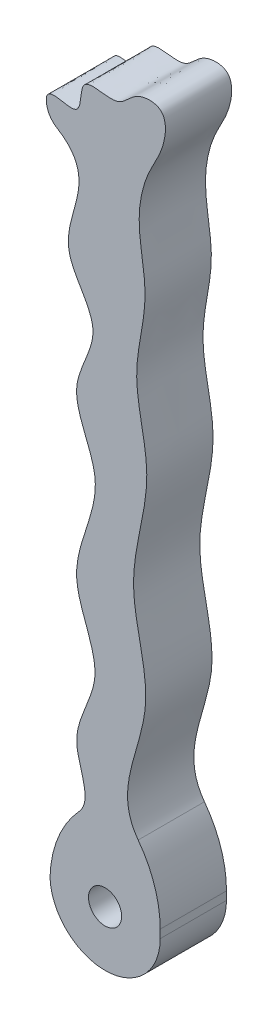
ISO-10303-21;
HEADER;
FILE_DESCRIPTION(('STEP AP214'),'2;1');
FILE_NAME('part.step','',(''),(''),'','','');
FILE_SCHEMA(('AUTOMOTIVE_DESIGN { 1 0 10303 214 1 1 1 1 }'));
ENDSEC;
DATA;
#1=APPLICATION_CONTEXT('core data for automotive mechanical design processes');
#2=APPLICATION_PROTOCOL_DEFINITION('international standard','automotive_design',2000,#1);
#3=PRODUCT_CONTEXT('',#1,'mechanical');
#4=PRODUCT('Part','Part','',(#3));
#5=PRODUCT_RELATED_PRODUCT_CATEGORY('part','',(#4));
#6=PRODUCT_DEFINITION_FORMATION('','',#4);
#7=PRODUCT_DEFINITION_CONTEXT('part definition',#1,'design');
#8=PRODUCT_DEFINITION('design','',#6,#7);
#9=PRODUCT_DEFINITION_SHAPE('','',#8);
#10=(LENGTH_UNIT() NAMED_UNIT(*) SI_UNIT(.MILLI.,.METRE.));
#11=(NAMED_UNIT(*) PLANE_ANGLE_UNIT() SI_UNIT($,.RADIAN.));
#12=(NAMED_UNIT(*) SI_UNIT($,.STERADIAN.) SOLID_ANGLE_UNIT());
#13=UNCERTAINTY_MEASURE_WITH_UNIT(LENGTH_MEASURE(1.E-05),#10,'distance_accuracy_value','');
#14=(GEOMETRIC_REPRESENTATION_CONTEXT(3) GLOBAL_UNCERTAINTY_ASSIGNED_CONTEXT((#13)) GLOBAL_UNIT_ASSIGNED_CONTEXT((#10,
#11,#12)) REPRESENTATION_CONTEXT('',''));
#15=CARTESIAN_POINT('',(0.,0.,0.));
#16=DIRECTION('',(0.,0.,1.));
#17=DIRECTION('',(1.,0.,0.));
#18=AXIS2_PLACEMENT_3D('',#15,#16,#17);
#19=CARTESIAN_POINT('',(4.07432307287909,27.0040889400727,6.));
#20=DIRECTION('',(0.,0.,1.));
#21=DIRECTION('',(1.,0.,0.));
#22=AXIS2_PLACEMENT_3D('',#19,#20,#21);
#23=PLANE('',#22);
#24=CARTESIAN_POINT('',(4.99,-4.99,6.));
#25=DIRECTION('',(0.,0.,1.));
#26=DIRECTION('',(1.,0.,0.));
#27=AXIS2_PLACEMENT_3D('',#24,#25,#26);
#28=CIRCLE('',#27,1.5);
#29=CARTESIAN_POINT('',(6.49,-4.99,6.));
#30=VERTEX_POINT('',#29);
#31=EDGE_CURVE('E137',#30,#30,#28,.T.);
#32=ORIENTED_EDGE('',*,*,#31,.F.);
#33=EDGE_LOOP('',(#32));
#34=FACE_BOUND('',#33,.T.);
#35=CARTESIAN_POINT('',(4.99,-4.99,6.));
#36=DIRECTION('',(0.,0.,1.));
#37=DIRECTION('',(1.,0.,0.));
#38=AXIS2_PLACEMENT_3D('',#35,#36,#37);
#39=CIRCLE('',#38,4.99);
#40=CARTESIAN_POINT('',(0.0036431932544205,-5.18064573381548,6.));
#41=VERTEX_POINT('',#40);
#42=CARTESIAN_POINT('',(9.98,-4.99,6.));
#43=VERTEX_POINT('',#42);
#44=EDGE_CURVE('E68',#41,#43,#39,.T.);
#45=ORIENTED_EDGE('',*,*,#44,.T.);
#46=DIRECTION('',(0.,1.,0.));
#47=VECTOR('',#46,1.);
#48=CARTESIAN_POINT('',(9.98,0.,6.));
#49=LINE('',#48,#47);
#50=CARTESIAN_POINT('',(9.98,-4.24386459225263,6.));
#51=VERTEX_POINT('',#50);
#52=EDGE_CURVE('E125',#43,#51,#49,.T.);
#53=ORIENTED_EDGE('',*,*,#52,.T.);
#54=CARTESIAN_POINT('',(-0.019999999999994,-4.24386459225263,6.));
#55=DIRECTION('',(0.,0.,1.));
#56=DIRECTION('',(1.,0.,0.));
#57=AXIS2_PLACEMENT_3D('',#54,#55,#56);
#58=CIRCLE('',#57,10.);
#59=CARTESIAN_POINT('',(7.98667396026505,1.74722646814812,6.));
#60=VERTEX_POINT('',#59);
#61=EDGE_CURVE('E160',#51,#60,#58,.T.);
#62=ORIENTED_EDGE('',*,*,#61,.T.);
#63=CARTESIAN_POINT('',(9.98,0.,6.));
#64=CARTESIAN_POINT('',(4.47490342142003,3.41650030145823,6.));
#65=CARTESIAN_POINT('',(10.7936674391867,11.1068859543439,6.));
#66=CARTESIAN_POINT('',(6.27028507343575,21.6732779777969,6.));
#67=CARTESIAN_POINT('',(9.84685355959956,30.2170188192904,6.));
#68=CARTESIAN_POINT('',(7.04609088717876,37.9736386752195,6.));
#69=CARTESIAN_POINT('',(9.26798486640884,44.5548895483187,6.));
#70=CARTESIAN_POINT('',(7.62484325053739,50.0403947930808,6.));
#71=CARTESIAN_POINT('',(8.66789346375684,54.3949271019187,6.));
#72=CARTESIAN_POINT('',(10.3371393951587,56.9019071742576,6.));
#73=CARTESIAN_POINT('',(10.8089638488774,60.4276984708432,6.));
#74=CARTESIAN_POINT('',(7.55999927260026,60.3083173980665,6.));
#75=CARTESIAN_POINT('',(6.24965715028379,57.9313320963328,6.));
#76=CARTESIAN_POINT('',(2.42632039661146,59.6713179523339,6.));
#77=CARTESIAN_POINT('',(3.2646972893959,54.364229545974,6.));
#78=CARTESIAN_POINT('',(-1.30019080009667,57.7321860270189,6.));
#79=CARTESIAN_POINT('',(0.,54.250736403552,6.));
#80=B_SPLINE_CURVE_WITH_KNOTS('',3,(#63,#64,#65,#66,#67,#68,#69,#70,#71,#72,#73,#74,#75,#76,#77,
#78,#79),.UNSPECIFIED.,.F.,.F.,(4,1,1,1,1,1,1,1,1,1,1,1,1,1,4),(0.,0.180812650342829,
0.29970693583266,0.426660188475201,0.523332248705061,0.611743870396005,0.68980196449708,
0.745444426402453,0.779487000439942,0.81881785744757,0.846512416164004,0.876173707632325,
0.915946811986844,0.946577953377389,1.),.UNSPECIFIED.);
#81=CARTESIAN_POINT('',(-0.295395150182294,55.2640439851758,6.));
#82=VERTEX_POINT('',#81);
#83=EDGE_CURVE('E152',#60,#82,#80,.T.);
#84=ORIENTED_EDGE('',*,*,#83,.T.);
#85=CARTESIAN_POINT('',(1.67511452998441,55.6062304845724,6.));
#86=DIRECTION('',(0.,0.,1.));
#87=DIRECTION('',(1.,0.,0.));
#88=AXIS2_PLACEMENT_3D('',#85,#86,#87);
#89=CIRCLE('',#88,2.);
#90=CARTESIAN_POINT('',(0.626417711124496,53.9032228562533,6.));
#91=VERTEX_POINT('',#90);
#92=EDGE_CURVE('E12',#82,#91,#89,.T.);
#93=ORIENTED_EDGE('',*,*,#92,.T.);
#94=CARTESIAN_POINT('',(0.,54.250736403552,6.));
#95=CARTESIAN_POINT('',(5.08439592728796,51.6989193078807,6.));
#96=CARTESIAN_POINT('',(-1.04048183505963,45.9919036493983,6.));
#97=CARTESIAN_POINT('',(5.44732212434061,39.8872478034224,6.));
#98=CARTESIAN_POINT('',(0.909066537170768,34.1690364818433,6.));
#99=CARTESIAN_POINT('',(6.00541926463897,27.5033546621597,6.));
#100=CARTESIAN_POINT('',(0.487031557597439,20.0548511445809,6.));
#101=CARTESIAN_POINT('',(5.67174348715676,12.844541350448,6.));
#102=CARTESIAN_POINT('',(0.403542472763163,6.21123578619222,6.));
#103=CARTESIAN_POINT('',(5.17705755879873,1.35031129040657,6.));
#104=CARTESIAN_POINT('',(0.,0.,6.));
#105=B_SPLINE_CURVE_WITH_KNOTS('',3,(#94,#95,#96,#97,#98,#99,#100,#101,#102,#103,#104),
.UNSPECIFIED.,.F.,.F.,(4,1,1,1,1,1,1,1,4),(0.,0.175024794858783,0.269809775423368,
0.365352015977889,0.476782251025548,0.633954019947958,0.755982766873036,0.862891175882645,1.),.UNSPECIFIED.);
#106=CARTESIAN_POINT('',(2.62712251322567,1.30523422636613,6.));
#107=VERTEX_POINT('',#106);
#108=EDGE_CURVE('E134',#91,#107,#105,.T.);
#109=ORIENTED_EDGE('',*,*,#108,.T.);
#110=CARTESIAN_POINT('',(10.,-5.45055422243954,6.));
#111=DIRECTION('',(0.,0.,1.));
#112=DIRECTION('',(1.,0.,0.));
#113=AXIS2_PLACEMENT_3D('',#110,#111,#112);
#114=CIRCLE('',#113,10.);
#115=EDGE_CURVE('E157',#107,#41,#114,.T.);
#116=ORIENTED_EDGE('',*,*,#115,.T.);
#117=EDGE_LOOP('',(#45,#53,#62,#84,#93,#109,#116));
#118=FACE_BOUND('',#117,.T.);
#119=ADVANCED_FACE('F53',(#34,#118),#23,.T.);
#120=CARTESIAN_POINT('',(4.07432307287909,27.0040889400727,0.));
#121=DIRECTION('',(0.,0.,1.));
#122=DIRECTION('',(1.,0.,0.));
#123=AXIS2_PLACEMENT_3D('',#120,#121,#122);
#124=PLANE('',#123);
#125=CARTESIAN_POINT('',(4.99,-4.99,0.));
#126=DIRECTION('',(0.,0.,1.));
#127=DIRECTION('',(1.,0.,0.));
#128=AXIS2_PLACEMENT_3D('',#125,#126,#127);
#129=CIRCLE('',#128,1.5);
#130=CARTESIAN_POINT('',(6.49,-4.99,0.));
#131=VERTEX_POINT('',#130);
#132=EDGE_CURVE('E187',#131,#131,#129,.T.);
#133=ORIENTED_EDGE('',*,*,#132,.T.);
#134=EDGE_LOOP('',(#133));
#135=FACE_BOUND('',#134,.T.);
#136=DIRECTION('',(0.,1.,0.));
#137=VECTOR('',#136,1.);
#138=CARTESIAN_POINT('',(9.98,0.,0.));
#139=LINE('',#138,#137);
#140=CARTESIAN_POINT('',(9.98,-4.99,0.));
#141=VERTEX_POINT('',#140);
#142=CARTESIAN_POINT('',(9.98,-4.24386459225263,0.));
#143=VERTEX_POINT('',#142);
#144=EDGE_CURVE('E123',#141,#143,#139,.T.);
#145=ORIENTED_EDGE('',*,*,#144,.F.);
#146=CARTESIAN_POINT('',(4.99,-4.99,0.));
#147=DIRECTION('',(0.,0.,1.));
#148=DIRECTION('',(1.,0.,0.));
#149=AXIS2_PLACEMENT_3D('',#146,#147,#148);
#150=CIRCLE('',#149,4.99);
#151=CARTESIAN_POINT('',(0.0036431932544205,-5.18064573381547,0.));
#152=VERTEX_POINT('',#151);
#153=EDGE_CURVE('E110',#152,#141,#150,.T.);
#154=ORIENTED_EDGE('',*,*,#153,.F.);
#155=CARTESIAN_POINT('',(10.,-5.45055422243954,0.));
#156=DIRECTION('',(0.,0.,1.));
#157=DIRECTION('',(1.,0.,0.));
#158=AXIS2_PLACEMENT_3D('',#155,#156,#157);
#159=CIRCLE('',#158,10.);
#160=CARTESIAN_POINT('',(2.62712251322567,1.30523422636613,0.));
#161=VERTEX_POINT('',#160);
#162=EDGE_CURVE('E151',#152,#161,#159,.F.);
#163=ORIENTED_EDGE('',*,*,#162,.T.);
#164=CARTESIAN_POINT('',(0.,54.250736403552,0.));
#165=CARTESIAN_POINT('',(5.08439592728796,51.6989193078807,0.));
#166=CARTESIAN_POINT('',(-1.04048183505963,45.9919036493983,0.));
#167=CARTESIAN_POINT('',(5.44732212434061,39.8872478034224,0.));
#168=CARTESIAN_POINT('',(0.909066537170768,34.1690364818433,0.));
#169=CARTESIAN_POINT('',(6.00541926463897,27.5033546621597,0.));
#170=CARTESIAN_POINT('',(0.487031557597439,20.0548511445809,0.));
#171=CARTESIAN_POINT('',(5.67174348715676,12.844541350448,0.));
#172=CARTESIAN_POINT('',(0.403542472763163,6.21123578619222,0.));
#173=CARTESIAN_POINT('',(5.17705755879873,1.35031129040657,0.));
#174=CARTESIAN_POINT('',(0.,0.,0.));
#175=B_SPLINE_CURVE_WITH_KNOTS('',3,(#164,#165,#166,#167,#168,#169,#170,#171,#172,#173,#174),
.UNSPECIFIED.,.F.,.F.,(4,1,1,1,1,1,1,1,4),(0.,0.175024794858783,0.269809775423368,
0.365352015977889,0.476782251025548,0.633954019947958,0.755982766873036,0.862891175882645,1.),.UNSPECIFIED.);
#176=CARTESIAN_POINT('',(0.626417711124506,53.9032228562533,0.));
#177=VERTEX_POINT('',#176);
#178=EDGE_CURVE('E132',#177,#161,#175,.T.);
#179=ORIENTED_EDGE('',*,*,#178,.F.);
#180=CARTESIAN_POINT('',(1.67511452998441,55.6062304845724,0.));
#181=DIRECTION('',(0.,0.,1.));
#182=DIRECTION('',(1.,0.,0.));
#183=AXIS2_PLACEMENT_3D('',#180,#181,#182);
#184=CIRCLE('',#183,2.);
#185=CARTESIAN_POINT('',(-0.295395150182294,55.2640439851758,0.));
#186=VERTEX_POINT('',#185);
#187=EDGE_CURVE('E168',#177,#186,#184,.F.);
#188=ORIENTED_EDGE('',*,*,#187,.T.);
#189=CARTESIAN_POINT('',(9.98,0.,0.));
#190=CARTESIAN_POINT('',(4.47490342142003,3.41650030145823,0.));
#191=CARTESIAN_POINT('',(10.7936674391867,11.1068859543439,0.));
#192=CARTESIAN_POINT('',(6.27028507343575,21.6732779777969,0.));
#193=CARTESIAN_POINT('',(9.84685355959956,30.2170188192904,0.));
#194=CARTESIAN_POINT('',(7.04609088717876,37.9736386752195,0.));
#195=CARTESIAN_POINT('',(9.26798486640884,44.5548895483187,0.));
#196=CARTESIAN_POINT('',(7.62484325053739,50.0403947930808,0.));
#197=CARTESIAN_POINT('',(8.66789346375684,54.3949271019187,0.));
#198=CARTESIAN_POINT('',(10.3371393951587,56.9019071742576,0.));
#199=CARTESIAN_POINT('',(10.8089638488774,60.4276984708432,0.));
#200=CARTESIAN_POINT('',(7.55999927260026,60.3083173980665,0.));
#201=CARTESIAN_POINT('',(6.24965715028379,57.9313320963328,0.));
#202=CARTESIAN_POINT('',(2.42632039661146,59.6713179523339,0.));
#203=CARTESIAN_POINT('',(3.2646972893959,54.364229545974,0.));
#204=CARTESIAN_POINT('',(-1.30019080009667,57.7321860270189,0.));
#205=CARTESIAN_POINT('',(0.,54.250736403552,0.));
#206=B_SPLINE_CURVE_WITH_KNOTS('',3,(#189,#190,#191,#192,#193,#194,#195,#196,#197,#198,#199,
#200,#201,#202,#203,#204,#205),.UNSPECIFIED.,.F.,.F.,(4,1,1,1,1,1,1,1,1,1,1,1,1,1,4),(0.,
0.180812650342829,0.29970693583266,0.426660188475201,0.523332248705061,0.611743870396005,
0.68980196449708,0.745444426402453,0.779487000439942,0.81881785744757,0.846512416164004,
0.876173707632325,0.915946811986844,0.946577953377389,1.),.UNSPECIFIED.);
#207=CARTESIAN_POINT('',(7.98667396026505,1.74722646814812,0.));
#208=VERTEX_POINT('',#207);
#209=EDGE_CURVE('E131',#208,#186,#206,.T.);
#210=ORIENTED_EDGE('',*,*,#209,.F.);
#211=CARTESIAN_POINT('',(-0.019999999999994,-4.24386459225263,0.));
#212=DIRECTION('',(0.,0.,1.));
#213=DIRECTION('',(1.,0.,0.));
#214=AXIS2_PLACEMENT_3D('',#211,#212,#213);
#215=CIRCLE('',#214,10.);
#216=EDGE_CURVE('E129',#208,#143,#215,.F.);
#217=ORIENTED_EDGE('',*,*,#216,.T.);
#218=EDGE_LOOP('',(#145,#154,#163,#179,#188,#210,#217));
#219=FACE_BOUND('',#218,.T.);
#220=ADVANCED_FACE('F127',(#135,#219),#124,.F.);
#221=CARTESIAN_POINT('',(9.98,0.,6.));
#222=DIRECTION('',(-1.,0.,0.));
#223=DIRECTION('',(0.,0.,1.));
#224=AXIS2_PLACEMENT_3D('',#221,#222,#223);
#225=PLANE('',#224);
#226=DIRECTION('',(0.,0.,1.));
#227=VECTOR('',#226,1.);
#228=CARTESIAN_POINT('',(9.98,-4.99,0.));
#229=LINE('',#228,#227);
#230=EDGE_CURVE('E113',#141,#43,#229,.T.);
#231=ORIENTED_EDGE('',*,*,#230,.F.);
#232=ORIENTED_EDGE('',*,*,#144,.T.);
#233=DIRECTION('',(0.,0.,-1.));
#234=VECTOR('',#233,1.);
#235=CARTESIAN_POINT('',(9.98,-4.24386459225263,6.));
#236=LINE('',#235,#234);
#237=EDGE_CURVE('E155',#143,#51,#236,.F.);
#238=ORIENTED_EDGE('',*,*,#237,.T.);
#239=ORIENTED_EDGE('',*,*,#52,.F.);
#240=EDGE_LOOP('',(#231,#232,#238,#239));
#241=FACE_BOUND('',#240,.T.);
#242=ADVANCED_FACE('F121',(#241),#225,.F.);
#243=CARTESIAN_POINT('',(10.,-5.45055422243954,3.));
#244=DIRECTION('',(0.,0.,-1.));
#245=DIRECTION('',(-1.,0.,0.));
#246=AXIS2_PLACEMENT_3D('',#243,#244,#245);
#247=CYLINDRICAL_SURFACE('',#246,10.);
#248=ORIENTED_EDGE('',*,*,#162,.F.);
#249=DIRECTION('',(0.,0.,1.));
#250=VECTOR('',#249,1.);
#251=CARTESIAN_POINT('',(0.0036431932544205,-5.18064573381547,0.));
#252=LINE('',#251,#250);
#253=EDGE_CURVE('E115',#152,#41,#252,.T.);
#254=ORIENTED_EDGE('',*,*,#253,.T.);
#255=ORIENTED_EDGE('',*,*,#115,.F.);
#256=DIRECTION('',(0.,0.,-1.));
#257=VECTOR('',#256,1.);
#258=CARTESIAN_POINT('',(2.62712251322567,1.30523422636613,0.));
#259=LINE('',#258,#257);
#260=EDGE_CURVE('E162',#161,#107,#259,.F.);
#261=ORIENTED_EDGE('',*,*,#260,.F.);
#262=EDGE_LOOP('',(#248,#254,#255,#261));
#263=FACE_BOUND('',#262,.T.);
#264=ADVANCED_FACE('F196',(#263),#247,.T.);
#265=DIRECTION('',(0.,0.,-1.));
#266=VECTOR('',#265,1.);
#267=SURFACE_OF_LINEAR_EXTRUSION('',#105,#266);
#268=ORIENTED_EDGE('',*,*,#108,.F.);
#269=DIRECTION('',(0.,0.,-1.));
#270=VECTOR('',#269,1.);
#271=CARTESIAN_POINT('',(0.626417711125187,53.9032228562529,6.));
#272=LINE('',#271,#270);
#273=EDGE_CURVE('E165',#91,#177,#272,.T.);
#274=ORIENTED_EDGE('',*,*,#273,.T.);
#275=ORIENTED_EDGE('',*,*,#178,.T.);
#276=ORIENTED_EDGE('',*,*,#260,.T.);
#277=EDGE_LOOP('',(#268,#274,#275,#276));
#278=FACE_BOUND('',#277,.T.);
#279=ADVANCED_FACE('F178',(#278),#267,.F.);
#280=DIRECTION('',(0.,0.,-1.));
#281=VECTOR('',#280,1.);
#282=SURFACE_OF_LINEAR_EXTRUSION('',#80,#281);
#283=ORIENTED_EDGE('',*,*,#209,.T.);
#284=DIRECTION('',(0.,0.,-1.));
#285=VECTOR('',#284,1.);
#286=CARTESIAN_POINT('',(-0.295395150184783,55.2640439851901,0.));
#287=LINE('',#286,#285);
#288=EDGE_CURVE('E61',#186,#82,#287,.F.);
#289=ORIENTED_EDGE('',*,*,#288,.T.);
#290=ORIENTED_EDGE('',*,*,#83,.F.);
#291=DIRECTION('',(0.,0.,-1.));
#292=VECTOR('',#291,1.);
#293=CARTESIAN_POINT('',(7.98667396026505,1.74722646814812,6.));
#294=LINE('',#293,#292);
#295=EDGE_CURVE('E145',#60,#208,#294,.T.);
#296=ORIENTED_EDGE('',*,*,#295,.T.);
#297=EDGE_LOOP('',(#283,#289,#290,#296));
#298=FACE_BOUND('',#297,.T.);
#299=ADVANCED_FACE('F172',(#298),#282,.F.);
#300=CARTESIAN_POINT('',(4.99,-4.99,6.));
#301=DIRECTION('',(0.,0.,-1.));
#302=DIRECTION('',(-1.,0.,0.));
#303=AXIS2_PLACEMENT_3D('',#300,#301,#302);
#304=CYLINDRICAL_SURFACE('',#303,1.5);
#305=ORIENTED_EDGE('',*,*,#31,.T.);
#306=EDGE_LOOP('',(#305));
#307=FACE_BOUND('',#306,.T.);
#308=ORIENTED_EDGE('',*,*,#132,.F.);
#309=EDGE_LOOP('',(#308));
#310=FACE_BOUND('',#309,.T.);
#311=ADVANCED_FACE('F200',(#307,#310),#304,.F.);
#312=CARTESIAN_POINT('',(-0.019999999999994,-4.24386459225263,3.));
#313=DIRECTION('',(0.,0.,-1.));
#314=DIRECTION('',(-1.,0.,0.));
#315=AXIS2_PLACEMENT_3D('',#312,#313,#314);
#316=CYLINDRICAL_SURFACE('',#315,10.);
#317=ORIENTED_EDGE('',*,*,#61,.F.);
#318=ORIENTED_EDGE('',*,*,#237,.F.);
#319=ORIENTED_EDGE('',*,*,#216,.F.);
#320=ORIENTED_EDGE('',*,*,#295,.F.);
#321=EDGE_LOOP('',(#317,#318,#319,#320));
#322=FACE_BOUND('',#321,.T.);
#323=ADVANCED_FACE('F198',(#322),#316,.T.);
#324=CARTESIAN_POINT('',(1.67511452998441,55.6062304845724,3.));
#325=DIRECTION('',(0.,0.,-1.));
#326=DIRECTION('',(-1.,0.,0.));
#327=AXIS2_PLACEMENT_3D('',#324,#325,#326);
#328=CYLINDRICAL_SURFACE('',#327,2.);
#329=ORIENTED_EDGE('',*,*,#92,.F.);
#330=ORIENTED_EDGE('',*,*,#288,.F.);
#331=ORIENTED_EDGE('',*,*,#187,.F.);
#332=ORIENTED_EDGE('',*,*,#273,.F.);
#333=EDGE_LOOP('',(#329,#330,#331,#332));
#334=FACE_BOUND('',#333,.T.);
#335=ADVANCED_FACE('F55',(#334),#328,.T.);
#336=CARTESIAN_POINT('',(4.99,-4.99,0.));
#337=DIRECTION('',(0.,0.,1.));
#338=DIRECTION('',(1.,0.,0.));
#339=AXIS2_PLACEMENT_3D('',#336,#337,#338);
#340=CYLINDRICAL_SURFACE('',#339,4.99);
#341=ORIENTED_EDGE('',*,*,#44,.F.);
#342=ORIENTED_EDGE('',*,*,#253,.F.);
#343=ORIENTED_EDGE('',*,*,#153,.T.);
#344=ORIENTED_EDGE('',*,*,#230,.T.);
#345=EDGE_LOOP('',(#341,#342,#343,#344));
#346=FACE_BOUND('',#345,.T.);
#347=ADVANCED_FACE('F112',(#346),#340,.T.);
#348=CLOSED_SHELL('',(#119,#220,#242,#264,#279,#299,#311,#323,#335,#347));
#349=MANIFOLD_SOLID_BREP('B2',#348);
#350=ADVANCED_BREP_SHAPE_REPRESENTATION('',(#18,#349),#14);
#351=SHAPE_DEFINITION_REPRESENTATION(#9,#350);
ENDSEC;
END-ISO-10303-21;
